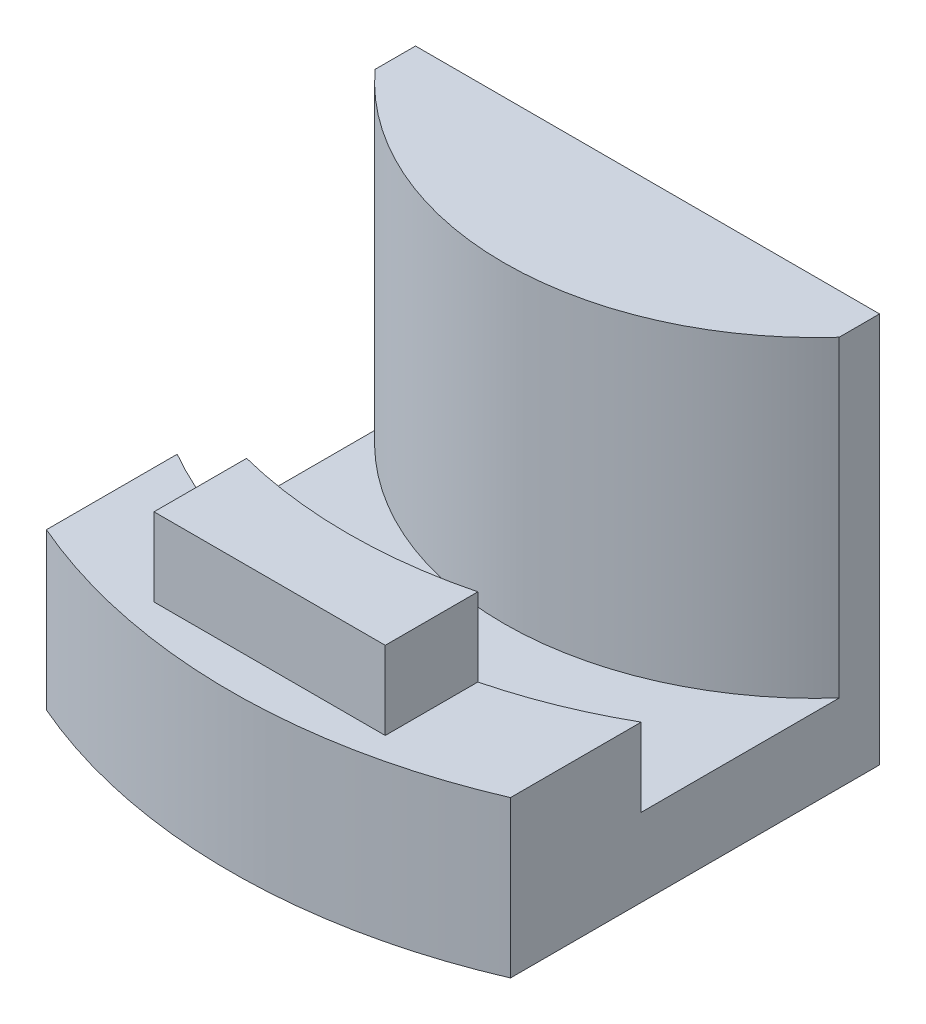
ISO-10303-21;
HEADER;
FILE_DESCRIPTION(('STEP AP214'),'2;1');
FILE_NAME('part.step','',(''),(''),'','','');
FILE_SCHEMA(('AUTOMOTIVE_DESIGN { 1 0 10303 214 1 1 1 1 }'));
ENDSEC;
DATA;
#1=APPLICATION_CONTEXT('core data for automotive mechanical design processes');
#2=APPLICATION_PROTOCOL_DEFINITION('international standard','automotive_design',2000,#1);
#3=PRODUCT_CONTEXT('',#1,'mechanical');
#4=PRODUCT('Part','Part','',(#3));
#5=PRODUCT_RELATED_PRODUCT_CATEGORY('part','',(#4));
#6=PRODUCT_DEFINITION_FORMATION('','',#4);
#7=PRODUCT_DEFINITION_CONTEXT('part definition',#1,'design');
#8=PRODUCT_DEFINITION('design','',#6,#7);
#9=PRODUCT_DEFINITION_SHAPE('','',#8);
#10=(LENGTH_UNIT() NAMED_UNIT(*) SI_UNIT(.MILLI.,.METRE.));
#11=(NAMED_UNIT(*) PLANE_ANGLE_UNIT() SI_UNIT($,.RADIAN.));
#12=(NAMED_UNIT(*) SI_UNIT($,.STERADIAN.) SOLID_ANGLE_UNIT());
#13=UNCERTAINTY_MEASURE_WITH_UNIT(LENGTH_MEASURE(1.E-05),#10,'distance_accuracy_value','');
#14=(GEOMETRIC_REPRESENTATION_CONTEXT(3) GLOBAL_UNCERTAINTY_ASSIGNED_CONTEXT((#13)) GLOBAL_UNIT_ASSIGNED_CONTEXT((#10,
#11,#12)) REPRESENTATION_CONTEXT('',''));
#15=CARTESIAN_POINT('',(0.,0.,0.));
#16=DIRECTION('',(0.,0.,1.));
#17=DIRECTION('',(1.,0.,0.));
#18=AXIS2_PLACEMENT_3D('',#15,#16,#17);
#19=CARTESIAN_POINT('',(0.,12.7,0.));
#20=DIRECTION('',(0.,1.,0.));
#21=DIRECTION('',(0.,0.,1.));
#22=AXIS2_PLACEMENT_3D('',#19,#20,#21);
#23=PLANE('',#22);
#24=DIRECTION('',(1.,0.,0.));
#25=VECTOR('',#24,1.);
#26=CARTESIAN_POINT('',(-9.398,12.7,44.45));
#27=LINE('',#26,#25);
#28=CARTESIAN_POINT('',(-9.398,12.7,44.45));
#29=VERTEX_POINT('',#28);
#30=CARTESIAN_POINT('',(9.398,12.7,44.45));
#31=VERTEX_POINT('',#30);
#32=EDGE_CURVE('E340',#29,#31,#27,.T.);
#33=ORIENTED_EDGE('',*,*,#32,.F.);
#34=DIRECTION('',(0.,0.,1.));
#35=VECTOR('',#34,1.);
#36=CARTESIAN_POINT('',(-9.398,12.7,44.45));
#37=LINE('',#36,#35);
#38=CARTESIAN_POINT('',(-9.39800000000002,12.7,36.9227246556914));
#39=VERTEX_POINT('',#38);
#40=EDGE_CURVE('E143',#39,#29,#37,.T.);
#41=ORIENTED_EDGE('',*,*,#40,.F.);
#42=CARTESIAN_POINT('',(0.,12.7,0.));
#43=DIRECTION('',(0.,1.,0.));
#44=DIRECTION('',(0.,0.,1.));
#45=AXIS2_PLACEMENT_3D('',#42,#43,#44);
#46=CIRCLE('',#45,38.1);
#47=CARTESIAN_POINT('',(-18.8595,12.7,33.1048223035557));
#48=VERTEX_POINT('',#47);
#49=EDGE_CURVE('E190',#48,#39,#46,.T.);
#50=ORIENTED_EDGE('',*,*,#49,.F.);
#51=DIRECTION('',(0.,0.,1.));
#52=VECTOR('',#51,1.);
#53=CARTESIAN_POINT('',(-18.8595,12.7,0.));
#54=LINE('',#53,#52);
#55=CARTESIAN_POINT('',(-18.8595,12.7,43.7316805616935));
#56=VERTEX_POINT('',#55);
#57=EDGE_CURVE('E179',#48,#56,#54,.T.);
#58=ORIENTED_EDGE('',*,*,#57,.T.);
#59=CARTESIAN_POINT('',(0.,12.7,0.));
#60=DIRECTION('',(0.,1.,0.));
#61=DIRECTION('',(0.,0.,1.));
#62=AXIS2_PLACEMENT_3D('',#59,#60,#61);
#63=CIRCLE('',#62,47.625);
#64=CARTESIAN_POINT('',(18.8595,12.7,43.7316805616935));
#65=VERTEX_POINT('',#64);
#66=EDGE_CURVE('E194',#56,#65,#63,.T.);
#67=ORIENTED_EDGE('',*,*,#66,.T.);
#68=DIRECTION('',(0.,0.,-1.));
#69=VECTOR('',#68,1.);
#70=CARTESIAN_POINT('',(18.8595,12.7,0.));
#71=LINE('',#70,#69);
#72=CARTESIAN_POINT('',(18.8595,12.7,33.1048223035557));
#73=VERTEX_POINT('',#72);
#74=EDGE_CURVE('E167',#65,#73,#71,.T.);
#75=ORIENTED_EDGE('',*,*,#74,.T.);
#76=CARTESIAN_POINT('',(9.398,12.7,36.9227246556914));
#77=VERTEX_POINT('',#76);
#78=EDGE_CURVE('E189',#77,#73,#46,.T.);
#79=ORIENTED_EDGE('',*,*,#78,.F.);
#80=DIRECTION('',(0.,0.,-1.));
#81=VECTOR('',#80,1.);
#82=CARTESIAN_POINT('',(9.398,12.7,44.45));
#83=LINE('',#82,#81);
#84=EDGE_CURVE('E139',#31,#77,#83,.T.);
#85=ORIENTED_EDGE('',*,*,#84,.F.);
#86=EDGE_LOOP('',(#33,#41,#50,#58,#67,#75,#79,#85));
#87=FACE_BOUND('',#86,.T.);
#88=ADVANCED_FACE('F32',(#87),#23,.T.);
#89=CARTESIAN_POINT('',(0.,6.35,0.));
#90=DIRECTION('',(0.,1.,0.));
#91=DIRECTION('',(0.,0.,1.));
#92=AXIS2_PLACEMENT_3D('',#89,#90,#91);
#93=PLANE('',#92);
#94=CARTESIAN_POINT('',(0.,6.35,0.));
#95=DIRECTION('',(0.,1.,0.));
#96=DIRECTION('',(0.,0.,1.));
#97=AXIS2_PLACEMENT_3D('',#94,#95,#96);
#98=CIRCLE('',#97,25.4);
#99=CARTESIAN_POINT('',(-18.8595,6.35,17.0140900359085));
#100=VERTEX_POINT('',#99);
#101=CARTESIAN_POINT('',(18.8595,6.35,17.0140900359085));
#102=VERTEX_POINT('',#101);
#103=EDGE_CURVE('E40',#100,#102,#98,.T.);
#104=ORIENTED_EDGE('',*,*,#103,.F.);
#105=DIRECTION('',(0.,0.,1.));
#106=VECTOR('',#105,1.);
#107=CARTESIAN_POINT('',(-18.8595,6.35,0.));
#108=LINE('',#107,#106);
#109=CARTESIAN_POINT('',(-18.8595,6.35,33.1048223035557));
#110=VERTEX_POINT('',#109);
#111=EDGE_CURVE('E182',#100,#110,#108,.T.);
#112=ORIENTED_EDGE('',*,*,#111,.T.);
#113=CARTESIAN_POINT('',(0.,6.35,0.));
#114=DIRECTION('',(0.,1.,0.));
#115=DIRECTION('',(0.,0.,1.));
#116=AXIS2_PLACEMENT_3D('',#113,#114,#115);
#117=CIRCLE('',#116,38.1);
#118=CARTESIAN_POINT('',(18.8595,6.35,33.1048223035557));
#119=VERTEX_POINT('',#118);
#120=EDGE_CURVE('E197',#119,#110,#117,.F.);
#121=ORIENTED_EDGE('',*,*,#120,.F.);
#122=DIRECTION('',(0.,0.,-1.));
#123=VECTOR('',#122,1.);
#124=CARTESIAN_POINT('',(18.8595,6.35,0.));
#125=LINE('',#124,#123);
#126=EDGE_CURVE('E170',#119,#102,#125,.T.);
#127=ORIENTED_EDGE('',*,*,#126,.T.);
#128=EDGE_LOOP('',(#104,#112,#121,#127));
#129=FACE_BOUND('',#128,.T.);
#130=ADVANCED_FACE('F212',(#129),#93,.T.);
#131=CARTESIAN_POINT('',(0.,31.75,0.));
#132=DIRECTION('',(0.,-1.,0.));
#133=DIRECTION('',(0.,0.,-1.));
#134=AXIS2_PLACEMENT_3D('',#131,#132,#133);
#135=CYLINDRICAL_SURFACE('',#134,25.4);
#136=DIRECTION('',(0.,-1.,0.));
#137=VECTOR('',#136,1.);
#138=CARTESIAN_POINT('',(-18.8595,31.75,17.0140900359085));
#139=LINE('',#138,#137);
#140=CARTESIAN_POINT('',(-18.8595,31.75,17.0140900359085));
#141=VERTEX_POINT('',#140);
#142=EDGE_CURVE('E187',#100,#141,#139,.F.);
#143=ORIENTED_EDGE('',*,*,#142,.F.);
#144=ORIENTED_EDGE('',*,*,#103,.T.);
#145=DIRECTION('',(0.,-1.,0.));
#146=VECTOR('',#145,1.);
#147=CARTESIAN_POINT('',(18.8595,31.75,17.0140900359085));
#148=LINE('',#147,#146);
#149=CARTESIAN_POINT('',(18.8595,31.75,17.0140900359085));
#150=VERTEX_POINT('',#149);
#151=EDGE_CURVE('E174',#150,#102,#148,.T.);
#152=ORIENTED_EDGE('',*,*,#151,.F.);
#153=CARTESIAN_POINT('',(0.,31.75,0.));
#154=DIRECTION('',(0.,1.,0.));
#155=DIRECTION('',(0.,0.,1.));
#156=AXIS2_PLACEMENT_3D('',#153,#154,#155);
#157=CIRCLE('',#156,25.4);
#158=EDGE_CURVE('E202',#141,#150,#157,.T.);
#159=ORIENTED_EDGE('',*,*,#158,.F.);
#160=EDGE_LOOP('',(#143,#144,#152,#159));
#161=FACE_BOUND('',#160,.T.);
#162=ADVANCED_FACE('F209',(#161),#135,.T.);
#163=CARTESIAN_POINT('',(0.,31.75,0.));
#164=DIRECTION('',(0.,1.,0.));
#165=DIRECTION('',(0.,0.,1.));
#166=AXIS2_PLACEMENT_3D('',#163,#164,#165);
#167=PLANE('',#166);
#168=DIRECTION('',(1.,0.,0.));
#169=VECTOR('',#168,1.);
#170=CARTESIAN_POINT('',(-18.8595,31.75,13.7319633530269));
#171=LINE('',#170,#169);
#172=CARTESIAN_POINT('',(-18.8595,31.75,13.7319633530269));
#173=VERTEX_POINT('',#172);
#174=CARTESIAN_POINT('',(18.8595,31.75,13.7319633530269));
#175=VERTEX_POINT('',#174);
#176=EDGE_CURVE('E155',#173,#175,#171,.T.);
#177=ORIENTED_EDGE('',*,*,#176,.F.);
#178=DIRECTION('',(0.,0.,-1.));
#179=VECTOR('',#178,1.);
#180=CARTESIAN_POINT('',(-18.8595,31.75,13.7319633530269));
#181=LINE('',#180,#179);
#182=EDGE_CURVE('E153',#141,#173,#181,.T.);
#183=ORIENTED_EDGE('',*,*,#182,.F.);
#184=ORIENTED_EDGE('',*,*,#158,.T.);
#185=DIRECTION('',(0.,0.,1.));
#186=VECTOR('',#185,1.);
#187=CARTESIAN_POINT('',(18.8595,31.75,13.7319633530269));
#188=LINE('',#187,#186);
#189=EDGE_CURVE('E157',#175,#150,#188,.T.);
#190=ORIENTED_EDGE('',*,*,#189,.F.);
#191=EDGE_LOOP('',(#177,#183,#184,#190));
#192=FACE_BOUND('',#191,.T.);
#193=ADVANCED_FACE('F233',(#192),#167,.T.);
#194=CARTESIAN_POINT('',(0.,12.7,0.));
#195=DIRECTION('',(0.,-1.,0.));
#196=DIRECTION('',(0.,0.,-1.));
#197=AXIS2_PLACEMENT_3D('',#194,#195,#196);
#198=CYLINDRICAL_SURFACE('',#197,47.625);
#199=DIRECTION('',(0.,-1.,0.));
#200=VECTOR('',#199,1.);
#201=CARTESIAN_POINT('',(-18.8595,12.7,43.7316805616935));
#202=LINE('',#201,#200);
#203=CARTESIAN_POINT('',(-18.8595,0.,43.7316805616935));
#204=VERTEX_POINT('',#203);
#205=EDGE_CURVE('E185',#204,#56,#202,.F.);
#206=ORIENTED_EDGE('',*,*,#205,.F.);
#207=CARTESIAN_POINT('',(0.,0.,0.));
#208=DIRECTION('',(0.,1.,0.));
#209=DIRECTION('',(0.,0.,1.));
#210=AXIS2_PLACEMENT_3D('',#207,#208,#209);
#211=CIRCLE('',#210,47.625);
#212=CARTESIAN_POINT('',(18.8595,0.,43.7316805616935));
#213=VERTEX_POINT('',#212);
#214=EDGE_CURVE('E193',#204,#213,#211,.T.);
#215=ORIENTED_EDGE('',*,*,#214,.T.);
#216=DIRECTION('',(0.,-1.,0.));
#217=VECTOR('',#216,1.);
#218=CARTESIAN_POINT('',(18.8595,12.7,43.7316805616935));
#219=LINE('',#218,#217);
#220=EDGE_CURVE('E55',#65,#213,#219,.T.);
#221=ORIENTED_EDGE('',*,*,#220,.F.);
#222=ORIENTED_EDGE('',*,*,#66,.F.);
#223=EDGE_LOOP('',(#206,#215,#221,#222));
#224=FACE_BOUND('',#223,.T.);
#225=ADVANCED_FACE('F223',(#224),#198,.T.);
#226=CARTESIAN_POINT('',(0.,12.7,0.));
#227=DIRECTION('',(0.,-1.,0.));
#228=DIRECTION('',(0.,0.,-1.));
#229=AXIS2_PLACEMENT_3D('',#226,#227,#228);
#230=CYLINDRICAL_SURFACE('',#229,38.1);
#231=ORIENTED_EDGE('',*,*,#120,.T.);
#232=DIRECTION('',(0.,-1.,0.));
#233=VECTOR('',#232,1.);
#234=CARTESIAN_POINT('',(-18.8595,12.7,33.1048223035557));
#235=LINE('',#234,#233);
#236=EDGE_CURVE('E176',#110,#48,#235,.F.);
#237=ORIENTED_EDGE('',*,*,#236,.T.);
#238=ORIENTED_EDGE('',*,*,#49,.T.);
#239=DIRECTION('',(0.,-1.,0.));
#240=VECTOR('',#239,1.);
#241=CARTESIAN_POINT('',(-9.39800000000002,19.05,36.9227246556914));
#242=LINE('',#241,#240);
#243=CARTESIAN_POINT('',(-9.39800000000002,19.05,36.9227246556914));
#244=VERTEX_POINT('',#243);
#245=EDGE_CURVE('E345',#244,#39,#242,.T.);
#246=ORIENTED_EDGE('',*,*,#245,.F.);
#247=CARTESIAN_POINT('',(0.,19.05,0.));
#248=DIRECTION('',(0.,-1.,0.));
#249=DIRECTION('',(0.,0.,1.));
#250=AXIS2_PLACEMENT_3D('',#247,#248,#249);
#251=CIRCLE('',#250,38.1);
#252=CARTESIAN_POINT('',(9.398,19.05,36.9227246556914));
#253=VERTEX_POINT('',#252);
#254=EDGE_CURVE('E136',#253,#244,#251,.T.);
#255=ORIENTED_EDGE('',*,*,#254,.F.);
#256=DIRECTION('',(0.,-1.,0.));
#257=VECTOR('',#256,1.);
#258=CARTESIAN_POINT('',(9.398,19.05,36.9227246556914));
#259=LINE('',#258,#257);
#260=EDGE_CURVE('E47',#253,#77,#259,.T.);
#261=ORIENTED_EDGE('',*,*,#260,.T.);
#262=ORIENTED_EDGE('',*,*,#78,.T.);
#263=DIRECTION('',(0.,-1.,0.));
#264=VECTOR('',#263,1.);
#265=CARTESIAN_POINT('',(18.8595,12.7,33.1048223035557));
#266=LINE('',#265,#264);
#267=EDGE_CURVE('E164',#73,#119,#266,.T.);
#268=ORIENTED_EDGE('',*,*,#267,.T.);
#269=EDGE_LOOP('',(#231,#237,#238,#246,#255,#261,#262,#268));
#270=FACE_BOUND('',#269,.T.);
#271=ADVANCED_FACE('F216',(#270),#230,.F.);
#272=CARTESIAN_POINT('',(0.,0.,0.));
#273=DIRECTION('',(0.,1.,0.));
#274=DIRECTION('',(0.,0.,1.));
#275=AXIS2_PLACEMENT_3D('',#272,#273,#274);
#276=PLANE('',#275);
#277=DIRECTION('',(0.,0.,1.));
#278=VECTOR('',#277,1.);
#279=CARTESIAN_POINT('',(-18.8595,0.,0.));
#280=LINE('',#279,#278);
#281=CARTESIAN_POINT('',(-18.8595,0.,13.7319633530269));
#282=VERTEX_POINT('',#281);
#283=EDGE_CURVE('E11',#282,#204,#280,.T.);
#284=ORIENTED_EDGE('',*,*,#283,.F.);
#285=DIRECTION('',(1.,0.,0.));
#286=VECTOR('',#285,1.);
#287=CARTESIAN_POINT('',(-18.8595,0.,13.7319633530269));
#288=LINE('',#287,#286);
#289=CARTESIAN_POINT('',(18.8595,0.,13.7319633530269));
#290=VERTEX_POINT('',#289);
#291=EDGE_CURVE('E145',#282,#290,#288,.T.);
#292=ORIENTED_EDGE('',*,*,#291,.T.);
#293=DIRECTION('',(0.,0.,1.));
#294=VECTOR('',#293,1.);
#295=CARTESIAN_POINT('',(18.8595,0.,13.7319633530269));
#296=LINE('',#295,#294);
#297=EDGE_CURVE('E148',#290,#213,#296,.T.);
#298=ORIENTED_EDGE('',*,*,#297,.T.);
#299=ORIENTED_EDGE('',*,*,#214,.F.);
#300=EDGE_LOOP('',(#284,#292,#298,#299));
#301=FACE_BOUND('',#300,.T.);
#302=ADVANCED_FACE('F34',(#301),#276,.F.);
#303=CARTESIAN_POINT('',(-18.8595,31.75,13.7319633530269));
#304=DIRECTION('',(-1.,0.,0.));
#305=DIRECTION('',(0.,0.,1.));
#306=AXIS2_PLACEMENT_3D('',#303,#304,#305);
#307=PLANE('',#306);
#308=ORIENTED_EDGE('',*,*,#142,.T.);
#309=ORIENTED_EDGE('',*,*,#182,.T.);
#310=DIRECTION('',(0.,-1.,0.));
#311=VECTOR('',#310,1.);
#312=CARTESIAN_POINT('',(-18.8595,31.75,13.7319633530269));
#313=LINE('',#312,#311);
#314=EDGE_CURVE('E162',#173,#282,#313,.T.);
#315=ORIENTED_EDGE('',*,*,#314,.T.);
#316=ORIENTED_EDGE('',*,*,#283,.T.);
#317=ORIENTED_EDGE('',*,*,#205,.T.);
#318=ORIENTED_EDGE('',*,*,#57,.F.);
#319=ORIENTED_EDGE('',*,*,#236,.F.);
#320=ORIENTED_EDGE('',*,*,#111,.F.);
#321=EDGE_LOOP('',(#308,#309,#315,#316,#317,#318,#319,#320));
#322=FACE_BOUND('',#321,.T.);
#323=ADVANCED_FACE('F237',(#322),#307,.T.);
#324=CARTESIAN_POINT('',(18.8595,31.75,13.7319633530269));
#325=DIRECTION('',(1.,0.,0.));
#326=DIRECTION('',(0.,0.,-1.));
#327=AXIS2_PLACEMENT_3D('',#324,#325,#326);
#328=PLANE('',#327);
#329=ORIENTED_EDGE('',*,*,#151,.T.);
#330=ORIENTED_EDGE('',*,*,#126,.F.);
#331=ORIENTED_EDGE('',*,*,#267,.F.);
#332=ORIENTED_EDGE('',*,*,#74,.F.);
#333=ORIENTED_EDGE('',*,*,#220,.T.);
#334=ORIENTED_EDGE('',*,*,#297,.F.);
#335=DIRECTION('',(0.,-1.,0.));
#336=VECTOR('',#335,1.);
#337=CARTESIAN_POINT('',(18.8595,31.75,13.7319633530269));
#338=LINE('',#337,#336);
#339=EDGE_CURVE('E158',#175,#290,#338,.T.);
#340=ORIENTED_EDGE('',*,*,#339,.F.);
#341=ORIENTED_EDGE('',*,*,#189,.T.);
#342=EDGE_LOOP('',(#329,#330,#331,#332,#333,#334,#340,#341));
#343=FACE_BOUND('',#342,.T.);
#344=ADVANCED_FACE('F215',(#343),#328,.T.);
#345=CARTESIAN_POINT('',(-18.8595,31.75,13.7319633530269));
#346=DIRECTION('',(0.,0.,-1.));
#347=DIRECTION('',(-1.,0.,0.));
#348=AXIS2_PLACEMENT_3D('',#345,#346,#347);
#349=PLANE('',#348);
#350=ORIENTED_EDGE('',*,*,#291,.F.);
#351=ORIENTED_EDGE('',*,*,#314,.F.);
#352=ORIENTED_EDGE('',*,*,#176,.T.);
#353=ORIENTED_EDGE('',*,*,#339,.T.);
#354=EDGE_LOOP('',(#350,#351,#352,#353));
#355=FACE_BOUND('',#354,.T.);
#356=ADVANCED_FACE('F238',(#355),#349,.T.);
#357=CARTESIAN_POINT('',(-9.398,19.05,44.45));
#358=DIRECTION('',(1.,0.,0.));
#359=DIRECTION('',(0.,0.,-1.));
#360=AXIS2_PLACEMENT_3D('',#357,#358,#359);
#361=PLANE('',#360);
#362=ORIENTED_EDGE('',*,*,#40,.T.);
#363=DIRECTION('',(0.,-1.,0.));
#364=VECTOR('',#363,1.);
#365=CARTESIAN_POINT('',(-9.398,19.05,44.45));
#366=LINE('',#365,#364);
#367=CARTESIAN_POINT('',(-9.398,19.05,44.45));
#368=VERTEX_POINT('',#367);
#369=EDGE_CURVE('E125',#368,#29,#366,.T.);
#370=ORIENTED_EDGE('',*,*,#369,.F.);
#371=DIRECTION('',(0.,0.,1.));
#372=VECTOR('',#371,1.);
#373=CARTESIAN_POINT('',(-9.398,19.05,44.45));
#374=LINE('',#373,#372);
#375=EDGE_CURVE('E132',#244,#368,#374,.T.);
#376=ORIENTED_EDGE('',*,*,#375,.F.);
#377=ORIENTED_EDGE('',*,*,#245,.T.);
#378=EDGE_LOOP('',(#362,#370,#376,#377));
#379=FACE_BOUND('',#378,.T.);
#380=ADVANCED_FACE('F141',(#379),#361,.F.);
#381=CARTESIAN_POINT('',(-9.398,19.05,44.45));
#382=DIRECTION('',(0.,0.,-1.));
#383=DIRECTION('',(-1.,0.,0.));
#384=AXIS2_PLACEMENT_3D('',#381,#382,#383);
#385=PLANE('',#384);
#386=ORIENTED_EDGE('',*,*,#32,.T.);
#387=DIRECTION('',(0.,-1.,0.));
#388=VECTOR('',#387,1.);
#389=CARTESIAN_POINT('',(9.398,19.05,44.45));
#390=LINE('',#389,#388);
#391=CARTESIAN_POINT('',(9.398,19.05,44.45));
#392=VERTEX_POINT('',#391);
#393=EDGE_CURVE('E128',#392,#31,#390,.T.);
#394=ORIENTED_EDGE('',*,*,#393,.F.);
#395=DIRECTION('',(1.,0.,0.));
#396=VECTOR('',#395,1.);
#397=CARTESIAN_POINT('',(-9.398,19.05,44.45));
#398=LINE('',#397,#396);
#399=EDGE_CURVE('E121',#368,#392,#398,.T.);
#400=ORIENTED_EDGE('',*,*,#399,.F.);
#401=ORIENTED_EDGE('',*,*,#369,.T.);
#402=EDGE_LOOP('',(#386,#394,#400,#401));
#403=FACE_BOUND('',#402,.T.);
#404=ADVANCED_FACE('F123',(#403),#385,.F.);
#405=CARTESIAN_POINT('',(9.398,19.05,44.45));
#406=DIRECTION('',(-1.,0.,0.));
#407=DIRECTION('',(0.,0.,1.));
#408=AXIS2_PLACEMENT_3D('',#405,#406,#407);
#409=PLANE('',#408);
#410=ORIENTED_EDGE('',*,*,#84,.T.);
#411=ORIENTED_EDGE('',*,*,#260,.F.);
#412=DIRECTION('',(0.,0.,-1.));
#413=VECTOR('',#412,1.);
#414=CARTESIAN_POINT('',(9.398,19.05,44.45));
#415=LINE('',#414,#413);
#416=EDGE_CURVE('E131',#392,#253,#415,.T.);
#417=ORIENTED_EDGE('',*,*,#416,.F.);
#418=ORIENTED_EDGE('',*,*,#393,.T.);
#419=EDGE_LOOP('',(#410,#411,#417,#418));
#420=FACE_BOUND('',#419,.T.);
#421=ADVANCED_FACE('F319',(#420),#409,.F.);
#422=CARTESIAN_POINT('',(0.,19.05,0.));
#423=DIRECTION('',(0.,1.,0.));
#424=DIRECTION('',(0.,0.,1.));
#425=AXIS2_PLACEMENT_3D('',#422,#423,#424);
#426=PLANE('',#425);
#427=ORIENTED_EDGE('',*,*,#375,.T.);
#428=ORIENTED_EDGE('',*,*,#399,.T.);
#429=ORIENTED_EDGE('',*,*,#416,.T.);
#430=ORIENTED_EDGE('',*,*,#254,.T.);
#431=EDGE_LOOP('',(#427,#428,#429,#430));
#432=FACE_BOUND('',#431,.T.);
#433=ADVANCED_FACE('F135',(#432),#426,.T.);
#434=CLOSED_SHELL('',(#88,#130,#162,#193,#225,#271,#302,#323,#344,#356,#380,#404,#421,#433));
#435=MANIFOLD_SOLID_BREP('B2',#434);
#436=ADVANCED_BREP_SHAPE_REPRESENTATION('',(#18,#435),#14);
#437=SHAPE_DEFINITION_REPRESENTATION(#9,#436);
ENDSEC;
END-ISO-10303-21;
